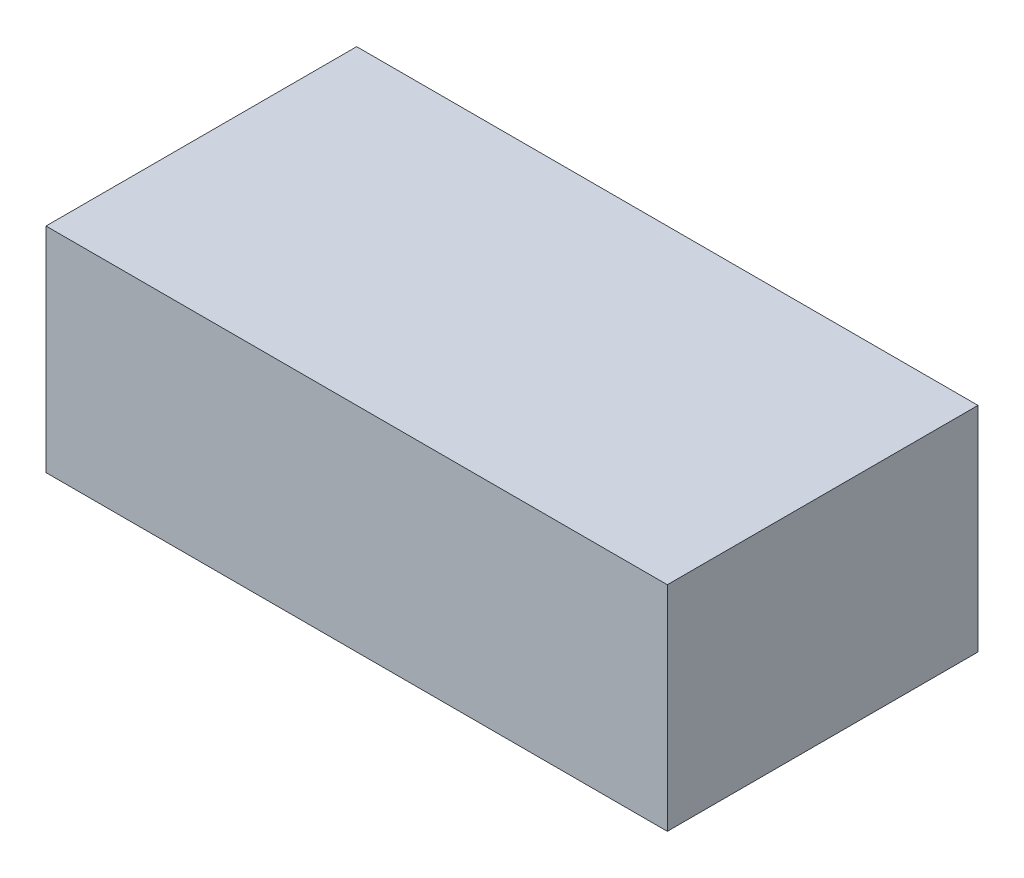
ISO-10303-21;
HEADER;
FILE_DESCRIPTION(('STEP AP214'),'2;1');
FILE_NAME('part.step','',(''),(''),'','','');
FILE_SCHEMA(('AUTOMOTIVE_DESIGN { 1 0 10303 214 1 1 1 1 }'));
ENDSEC;
DATA;
#1=APPLICATION_CONTEXT('core data for automotive mechanical design processes');
#2=APPLICATION_PROTOCOL_DEFINITION('international standard','automotive_design',2000,#1);
#3=PRODUCT_CONTEXT('',#1,'mechanical');
#4=PRODUCT('Part','Part','',(#3));
#5=PRODUCT_RELATED_PRODUCT_CATEGORY('part','',(#4));
#6=PRODUCT_DEFINITION_FORMATION('','',#4);
#7=PRODUCT_DEFINITION_CONTEXT('part definition',#1,'design');
#8=PRODUCT_DEFINITION('design','',#6,#7);
#9=PRODUCT_DEFINITION_SHAPE('','',#8);
#10=(LENGTH_UNIT() NAMED_UNIT(*) SI_UNIT(.MILLI.,.METRE.));
#11=(NAMED_UNIT(*) PLANE_ANGLE_UNIT() SI_UNIT($,.RADIAN.));
#12=(NAMED_UNIT(*) SI_UNIT($,.STERADIAN.) SOLID_ANGLE_UNIT());
#13=UNCERTAINTY_MEASURE_WITH_UNIT(LENGTH_MEASURE(1.E-05),#10,'distance_accuracy_value','');
#14=(GEOMETRIC_REPRESENTATION_CONTEXT(3) GLOBAL_UNCERTAINTY_ASSIGNED_CONTEXT((#13)) GLOBAL_UNIT_ASSIGNED_CONTEXT((#10,
#11,#12)) REPRESENTATION_CONTEXT('',''));
#15=CARTESIAN_POINT('',(0.,0.,0.));
#16=DIRECTION('',(0.,0.,1.));
#17=DIRECTION('',(1.,0.,0.));
#18=AXIS2_PLACEMENT_3D('',#15,#16,#17);
#19=CARTESIAN_POINT('',(0.8,0.55,-0.4));
#20=DIRECTION('',(-1.,0.,0.));
#21=DIRECTION('',(0.,0.,1.));
#22=AXIS2_PLACEMENT_3D('',#19,#20,#21);
#23=PLANE('',#22);
#24=DIRECTION('',(0.,0.,-1.));
#25=VECTOR('',#24,1.);
#26=CARTESIAN_POINT('',(0.8,0.,-0.4));
#27=LINE('',#26,#25);
#28=CARTESIAN_POINT('',(0.8,0.,0.4));
#29=VERTEX_POINT('',#28);
#30=CARTESIAN_POINT('',(0.8,0.,-0.4));
#31=VERTEX_POINT('',#30);
#32=EDGE_CURVE('E104',#29,#31,#27,.T.);
#33=ORIENTED_EDGE('',*,*,#32,.T.);
#34=DIRECTION('',(0.,-1.,0.));
#35=VECTOR('',#34,1.);
#36=CARTESIAN_POINT('',(0.8,0.55,-0.4));
#37=LINE('',#36,#35);
#38=CARTESIAN_POINT('',(0.8,0.55,-0.4));
#39=VERTEX_POINT('',#38);
#40=EDGE_CURVE('E11',#39,#31,#37,.T.);
#41=ORIENTED_EDGE('',*,*,#40,.F.);
#42=DIRECTION('',(0.,0.,-1.));
#43=VECTOR('',#42,1.);
#44=CARTESIAN_POINT('',(0.8,0.55,-0.4));
#45=LINE('',#44,#43);
#46=CARTESIAN_POINT('',(0.8,0.55,0.4));
#47=VERTEX_POINT('',#46);
#48=EDGE_CURVE('E92',#47,#39,#45,.T.);
#49=ORIENTED_EDGE('',*,*,#48,.F.);
#50=DIRECTION('',(0.,-1.,0.));
#51=VECTOR('',#50,1.);
#52=CARTESIAN_POINT('',(0.8,0.55,0.4));
#53=LINE('',#52,#51);
#54=EDGE_CURVE('E100',#47,#29,#53,.T.);
#55=ORIENTED_EDGE('',*,*,#54,.T.);
#56=EDGE_LOOP('',(#33,#41,#49,#55));
#57=FACE_BOUND('',#56,.T.);
#58=ADVANCED_FACE('F41',(#57),#23,.F.);
#59=CARTESIAN_POINT('',(-0.8,0.55,-0.4));
#60=DIRECTION('',(0.,0.,1.));
#61=DIRECTION('',(1.,0.,0.));
#62=AXIS2_PLACEMENT_3D('',#59,#60,#61);
#63=PLANE('',#62);
#64=DIRECTION('',(-1.,0.,0.));
#65=VECTOR('',#64,1.);
#66=CARTESIAN_POINT('',(-0.8,0.,-0.4));
#67=LINE('',#66,#65);
#68=CARTESIAN_POINT('',(-0.8,0.,-0.4));
#69=VERTEX_POINT('',#68);
#70=EDGE_CURVE('E96',#31,#69,#67,.T.);
#71=ORIENTED_EDGE('',*,*,#70,.T.);
#72=DIRECTION('',(0.,-1.,0.));
#73=VECTOR('',#72,1.);
#74=CARTESIAN_POINT('',(-0.8,0.55,-0.4));
#75=LINE('',#74,#73);
#76=CARTESIAN_POINT('',(-0.8,0.55,-0.4));
#77=VERTEX_POINT('',#76);
#78=EDGE_CURVE('E49',#77,#69,#75,.T.);
#79=ORIENTED_EDGE('',*,*,#78,.F.);
#80=DIRECTION('',(-1.,0.,0.));
#81=VECTOR('',#80,1.);
#82=CARTESIAN_POINT('',(-0.8,0.55,-0.4));
#83=LINE('',#82,#81);
#84=EDGE_CURVE('E87',#39,#77,#83,.T.);
#85=ORIENTED_EDGE('',*,*,#84,.F.);
#86=ORIENTED_EDGE('',*,*,#40,.T.);
#87=EDGE_LOOP('',(#71,#79,#85,#86));
#88=FACE_BOUND('',#87,.T.);
#89=ADVANCED_FACE('F95',(#88),#63,.F.);
#90=CARTESIAN_POINT('',(-0.8,0.55,-0.4));
#91=DIRECTION('',(1.,0.,0.));
#92=DIRECTION('',(0.,0.,-1.));
#93=AXIS2_PLACEMENT_3D('',#90,#91,#92);
#94=PLANE('',#93);
#95=DIRECTION('',(0.,0.,1.));
#96=VECTOR('',#95,1.);
#97=CARTESIAN_POINT('',(-0.8,0.,-0.4));
#98=LINE('',#97,#96);
#99=CARTESIAN_POINT('',(-0.8,0.,0.4));
#100=VERTEX_POINT('',#99);
#101=EDGE_CURVE('E74',#69,#100,#98,.T.);
#102=ORIENTED_EDGE('',*,*,#101,.T.);
#103=DIRECTION('',(0.,-1.,0.));
#104=VECTOR('',#103,1.);
#105=CARTESIAN_POINT('',(-0.8,0.55,0.4));
#106=LINE('',#105,#104);
#107=CARTESIAN_POINT('',(-0.8,0.55,0.4));
#108=VERTEX_POINT('',#107);
#109=EDGE_CURVE('E97',#108,#100,#106,.T.);
#110=ORIENTED_EDGE('',*,*,#109,.F.);
#111=DIRECTION('',(0.,0.,1.));
#112=VECTOR('',#111,1.);
#113=CARTESIAN_POINT('',(-0.8,0.55,-0.4));
#114=LINE('',#113,#112);
#115=EDGE_CURVE('E90',#77,#108,#114,.T.);
#116=ORIENTED_EDGE('',*,*,#115,.F.);
#117=ORIENTED_EDGE('',*,*,#78,.T.);
#118=EDGE_LOOP('',(#102,#110,#116,#117));
#119=FACE_BOUND('',#118,.T.);
#120=ADVANCED_FACE('F98',(#119),#94,.F.);
#121=CARTESIAN_POINT('',(-0.8,0.55,0.4));
#122=DIRECTION('',(0.,0.,-1.));
#123=DIRECTION('',(-1.,0.,0.));
#124=AXIS2_PLACEMENT_3D('',#121,#122,#123);
#125=PLANE('',#124);
#126=DIRECTION('',(1.,0.,0.));
#127=VECTOR('',#126,1.);
#128=CARTESIAN_POINT('',(-0.8,0.,0.4));
#129=LINE('',#128,#127);
#130=EDGE_CURVE('E80',#100,#29,#129,.T.);
#131=ORIENTED_EDGE('',*,*,#130,.T.);
#132=ORIENTED_EDGE('',*,*,#54,.F.);
#133=DIRECTION('',(1.,0.,0.));
#134=VECTOR('',#133,1.);
#135=CARTESIAN_POINT('',(-0.8,0.55,0.4));
#136=LINE('',#135,#134);
#137=EDGE_CURVE('E57',#108,#47,#136,.T.);
#138=ORIENTED_EDGE('',*,*,#137,.F.);
#139=ORIENTED_EDGE('',*,*,#109,.T.);
#140=EDGE_LOOP('',(#131,#132,#138,#139));
#141=FACE_BOUND('',#140,.T.);
#142=ADVANCED_FACE('F111',(#141),#125,.F.);
#143=CARTESIAN_POINT('',(0.,0.55,0.));
#144=DIRECTION('',(0.,1.,0.));
#145=DIRECTION('',(0.,0.,1.));
#146=AXIS2_PLACEMENT_3D('',#143,#144,#145);
#147=PLANE('',#146);
#148=ORIENTED_EDGE('',*,*,#48,.T.);
#149=ORIENTED_EDGE('',*,*,#84,.T.);
#150=ORIENTED_EDGE('',*,*,#115,.T.);
#151=ORIENTED_EDGE('',*,*,#137,.T.);
#152=EDGE_LOOP('',(#148,#149,#150,#151));
#153=FACE_BOUND('',#152,.T.);
#154=ADVANCED_FACE('F88',(#153),#147,.T.);
#155=CARTESIAN_POINT('',(0.,0.,0.));
#156=DIRECTION('',(0.,1.,0.));
#157=DIRECTION('',(0.,0.,1.));
#158=AXIS2_PLACEMENT_3D('',#155,#156,#157);
#159=PLANE('',#158);
#160=ORIENTED_EDGE('',*,*,#32,.F.);
#161=ORIENTED_EDGE('',*,*,#130,.F.);
#162=ORIENTED_EDGE('',*,*,#101,.F.);
#163=ORIENTED_EDGE('',*,*,#70,.F.);
#164=EDGE_LOOP('',(#160,#161,#162,#163));
#165=FACE_BOUND('',#164,.T.);
#166=ADVANCED_FACE('F114',(#165),#159,.F.);
#167=CLOSED_SHELL('',(#58,#89,#120,#142,#154,#166));
#168=MANIFOLD_SOLID_BREP('B2',#167);
#169=ADVANCED_BREP_SHAPE_REPRESENTATION('',(#18,#168),#14);
#170=SHAPE_DEFINITION_REPRESENTATION(#9,#169);
ENDSEC;
END-ISO-10303-21;
